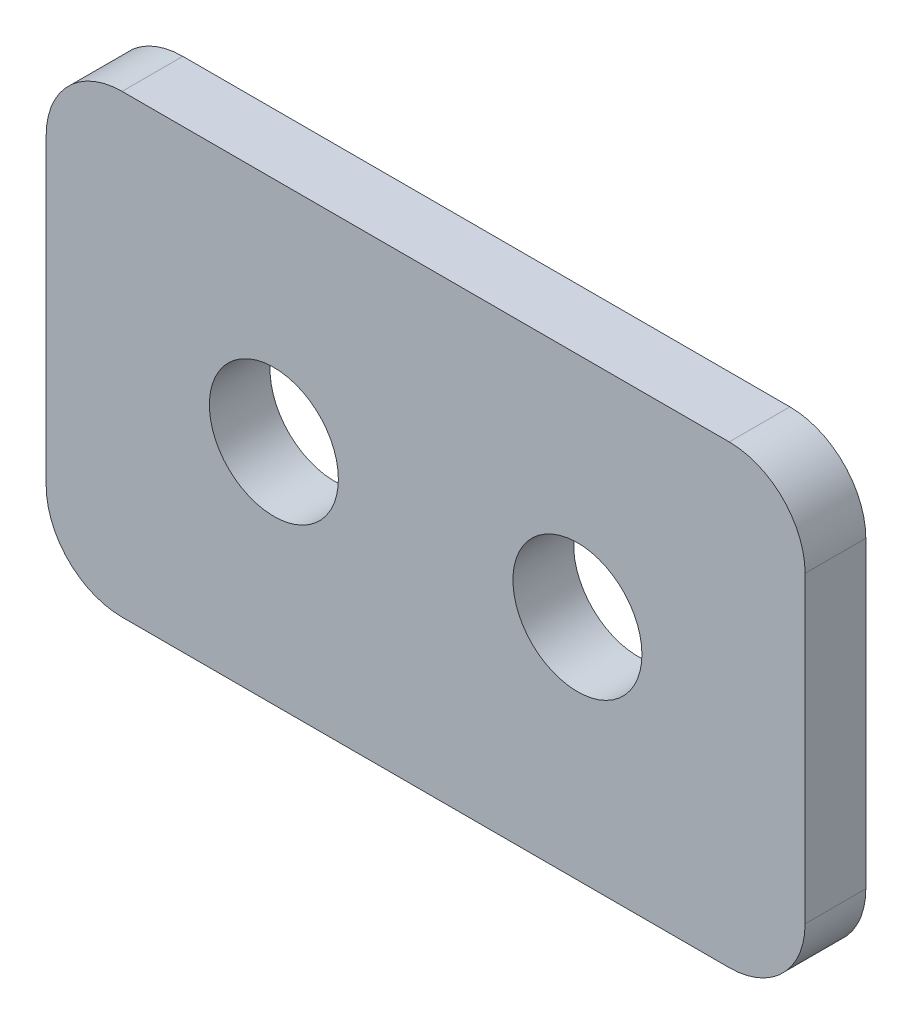
ISO-10303-21;
HEADER;
FILE_DESCRIPTION(('STEP AP214'),'2;1');
FILE_NAME('part.step','',(''),(''),'','','');
FILE_SCHEMA(('AUTOMOTIVE_DESIGN { 1 0 10303 214 1 1 1 1 }'));
ENDSEC;
DATA;
#1=APPLICATION_CONTEXT('core data for automotive mechanical design processes');
#2=APPLICATION_PROTOCOL_DEFINITION('international standard','automotive_design',2000,#1);
#3=PRODUCT_CONTEXT('',#1,'mechanical');
#4=PRODUCT('Part','Part','',(#3));
#5=PRODUCT_RELATED_PRODUCT_CATEGORY('part','',(#4));
#6=PRODUCT_DEFINITION_FORMATION('','',#4);
#7=PRODUCT_DEFINITION_CONTEXT('part definition',#1,'design');
#8=PRODUCT_DEFINITION('design','',#6,#7);
#9=PRODUCT_DEFINITION_SHAPE('','',#8);
#10=(LENGTH_UNIT() NAMED_UNIT(*) SI_UNIT(.MILLI.,.METRE.));
#11=(NAMED_UNIT(*) PLANE_ANGLE_UNIT() SI_UNIT($,.RADIAN.));
#12=(NAMED_UNIT(*) SI_UNIT($,.STERADIAN.) SOLID_ANGLE_UNIT());
#13=UNCERTAINTY_MEASURE_WITH_UNIT(LENGTH_MEASURE(1.E-05),#10,'distance_accuracy_value','');
#14=(GEOMETRIC_REPRESENTATION_CONTEXT(3) GLOBAL_UNCERTAINTY_ASSIGNED_CONTEXT((#13)) GLOBAL_UNIT_ASSIGNED_CONTEXT((#10,
#11,#12)) REPRESENTATION_CONTEXT('',''));
#15=CARTESIAN_POINT('',(0.,0.,0.));
#16=DIRECTION('',(0.,0.,1.));
#17=DIRECTION('',(1.,0.,0.));
#18=AXIS2_PLACEMENT_3D('',#15,#16,#17);
#19=CARTESIAN_POINT('',(-20.,-10.,-4.));
#20=DIRECTION('',(0.,0.,1.));
#21=DIRECTION('',(1.,0.,0.));
#22=AXIS2_PLACEMENT_3D('',#19,#20,#21);
#23=CYLINDRICAL_SURFACE('',#22,5.);
#24=CARTESIAN_POINT('',(-20.,-10.,0.));
#25=DIRECTION('',(0.,0.,1.));
#26=DIRECTION('',(-1.,0.,0.));
#27=AXIS2_PLACEMENT_3D('',#24,#25,#26);
#28=CIRCLE('',#27,5.);
#29=CARTESIAN_POINT('',(-25.,-9.99999999999996,0.));
#30=VERTEX_POINT('',#29);
#31=CARTESIAN_POINT('',(-20.,-15.,0.));
#32=VERTEX_POINT('',#31);
#33=EDGE_CURVE('E137',#30,#32,#28,.T.);
#34=ORIENTED_EDGE('',*,*,#33,.F.);
#35=DIRECTION('',(0.,0.,1.));
#36=VECTOR('',#35,1.);
#37=CARTESIAN_POINT('',(-25.,-9.99999999999996,-4.));
#38=LINE('',#37,#36);
#39=CARTESIAN_POINT('',(-25.,-9.99999999999996,-4.));
#40=VERTEX_POINT('',#39);
#41=EDGE_CURVE('E11',#40,#30,#38,.T.);
#42=ORIENTED_EDGE('',*,*,#41,.F.);
#43=CARTESIAN_POINT('',(-20.,-10.,-4.));
#44=DIRECTION('',(0.,0.,1.));
#45=DIRECTION('',(-1.,0.,0.));
#46=AXIS2_PLACEMENT_3D('',#43,#44,#45);
#47=CIRCLE('',#46,5.);
#48=CARTESIAN_POINT('',(-20.,-15.,-4.));
#49=VERTEX_POINT('',#48);
#50=EDGE_CURVE('E158',#40,#49,#47,.T.);
#51=ORIENTED_EDGE('',*,*,#50,.T.);
#52=DIRECTION('',(0.,0.,1.));
#53=VECTOR('',#52,1.);
#54=CARTESIAN_POINT('',(-20.,-15.,-4.));
#55=LINE('',#54,#53);
#56=EDGE_CURVE('E43',#49,#32,#55,.T.);
#57=ORIENTED_EDGE('',*,*,#56,.T.);
#58=EDGE_LOOP('',(#34,#42,#51,#57));
#59=FACE_BOUND('',#58,.T.);
#60=ADVANCED_FACE('F40',(#59),#23,.T.);
#61=CARTESIAN_POINT('',(-25.,-9.99999999999996,-4.));
#62=DIRECTION('',(-1.,0.,0.));
#63=DIRECTION('',(0.,0.,1.));
#64=AXIS2_PLACEMENT_3D('',#61,#62,#63);
#65=PLANE('',#64);
#66=DIRECTION('',(0.,-1.,0.));
#67=VECTOR('',#66,1.);
#68=CARTESIAN_POINT('',(-25.,-9.99999999999996,0.));
#69=LINE('',#68,#67);
#70=CARTESIAN_POINT('',(-25.,9.99999999999996,0.));
#71=VERTEX_POINT('',#70);
#72=EDGE_CURVE('E156',#71,#30,#69,.T.);
#73=ORIENTED_EDGE('',*,*,#72,.F.);
#74=DIRECTION('',(0.,0.,1.));
#75=VECTOR('',#74,1.);
#76=CARTESIAN_POINT('',(-25.,9.99999999999996,-4.));
#77=LINE('',#76,#75);
#78=CARTESIAN_POINT('',(-25.,9.99999999999996,-4.));
#79=VERTEX_POINT('',#78);
#80=EDGE_CURVE('E49',#79,#71,#77,.T.);
#81=ORIENTED_EDGE('',*,*,#80,.F.);
#82=DIRECTION('',(0.,-1.,0.));
#83=VECTOR('',#82,1.);
#84=CARTESIAN_POINT('',(-25.,-9.99999999999996,-4.));
#85=LINE('',#84,#83);
#86=EDGE_CURVE('E127',#79,#40,#85,.T.);
#87=ORIENTED_EDGE('',*,*,#86,.T.);
#88=ORIENTED_EDGE('',*,*,#41,.T.);
#89=EDGE_LOOP('',(#73,#81,#87,#88));
#90=FACE_BOUND('',#89,.T.);
#91=ADVANCED_FACE('F170',(#90),#65,.T.);
#92=CARTESIAN_POINT('',(-20.,10.,-4.));
#93=DIRECTION('',(0.,0.,1.));
#94=DIRECTION('',(1.,0.,0.));
#95=AXIS2_PLACEMENT_3D('',#92,#93,#94);
#96=CYLINDRICAL_SURFACE('',#95,5.);
#97=CARTESIAN_POINT('',(-20.,10.,0.));
#98=DIRECTION('',(0.,0.,1.));
#99=DIRECTION('',(-1.,0.,0.));
#100=AXIS2_PLACEMENT_3D('',#97,#98,#99);
#101=CIRCLE('',#100,5.);
#102=CARTESIAN_POINT('',(-20.,15.,0.));
#103=VERTEX_POINT('',#102);
#104=EDGE_CURVE('E114',#103,#71,#101,.T.);
#105=ORIENTED_EDGE('',*,*,#104,.F.);
#106=DIRECTION('',(0.,0.,1.));
#107=VECTOR('',#106,1.);
#108=CARTESIAN_POINT('',(-20.,15.,-4.));
#109=LINE('',#108,#107);
#110=CARTESIAN_POINT('',(-20.,15.,-4.));
#111=VERTEX_POINT('',#110);
#112=EDGE_CURVE('E109',#111,#103,#109,.T.);
#113=ORIENTED_EDGE('',*,*,#112,.F.);
#114=CARTESIAN_POINT('',(-20.,10.,-4.));
#115=DIRECTION('',(0.,0.,1.));
#116=DIRECTION('',(-1.,0.,0.));
#117=AXIS2_PLACEMENT_3D('',#114,#115,#116);
#118=CIRCLE('',#117,5.);
#119=EDGE_CURVE('E112',#111,#79,#118,.T.);
#120=ORIENTED_EDGE('',*,*,#119,.T.);
#121=ORIENTED_EDGE('',*,*,#80,.T.);
#122=EDGE_LOOP('',(#105,#113,#120,#121));
#123=FACE_BOUND('',#122,.T.);
#124=ADVANCED_FACE('F111',(#123),#96,.T.);
#125=CARTESIAN_POINT('',(-20.,15.,-4.));
#126=DIRECTION('',(0.,1.,0.));
#127=DIRECTION('',(0.,0.,1.));
#128=AXIS2_PLACEMENT_3D('',#125,#126,#127);
#129=PLANE('',#128);
#130=DIRECTION('',(-1.,0.,0.));
#131=VECTOR('',#130,1.);
#132=CARTESIAN_POINT('',(-20.,15.,0.));
#133=LINE('',#132,#131);
#134=CARTESIAN_POINT('',(20.,15.,0.));
#135=VERTEX_POINT('',#134);
#136=EDGE_CURVE('E153',#135,#103,#133,.T.);
#137=ORIENTED_EDGE('',*,*,#136,.F.);
#138=DIRECTION('',(0.,0.,1.));
#139=VECTOR('',#138,1.);
#140=CARTESIAN_POINT('',(20.,15.,-4.));
#141=LINE('',#140,#139);
#142=CARTESIAN_POINT('',(20.,15.,-4.));
#143=VERTEX_POINT('',#142);
#144=EDGE_CURVE('E119',#143,#135,#141,.T.);
#145=ORIENTED_EDGE('',*,*,#144,.F.);
#146=DIRECTION('',(-1.,0.,0.));
#147=VECTOR('',#146,1.);
#148=CARTESIAN_POINT('',(-20.,15.,-4.));
#149=LINE('',#148,#147);
#150=EDGE_CURVE('E125',#143,#111,#149,.T.);
#151=ORIENTED_EDGE('',*,*,#150,.T.);
#152=ORIENTED_EDGE('',*,*,#112,.T.);
#153=EDGE_LOOP('',(#137,#145,#151,#152));
#154=FACE_BOUND('',#153,.T.);
#155=ADVANCED_FACE('F129',(#154),#129,.T.);
#156=CARTESIAN_POINT('',(20.,10.,-4.));
#157=DIRECTION('',(0.,0.,1.));
#158=DIRECTION('',(1.,0.,0.));
#159=AXIS2_PLACEMENT_3D('',#156,#157,#158);
#160=CYLINDRICAL_SURFACE('',#159,5.);
#161=CARTESIAN_POINT('',(20.,10.,0.));
#162=DIRECTION('',(0.,0.,1.));
#163=DIRECTION('',(-1.,0.,0.));
#164=AXIS2_PLACEMENT_3D('',#161,#162,#163);
#165=CIRCLE('',#164,5.);
#166=CARTESIAN_POINT('',(25.,9.99999999999996,0.));
#167=VERTEX_POINT('',#166);
#168=EDGE_CURVE('E150',#167,#135,#165,.T.);
#169=ORIENTED_EDGE('',*,*,#168,.F.);
#170=DIRECTION('',(0.,0.,1.));
#171=VECTOR('',#170,1.);
#172=CARTESIAN_POINT('',(25.,9.99999999999996,-4.));
#173=LINE('',#172,#171);
#174=CARTESIAN_POINT('',(25.,9.99999999999996,-4.));
#175=VERTEX_POINT('',#174);
#176=EDGE_CURVE('E162',#175,#167,#173,.T.);
#177=ORIENTED_EDGE('',*,*,#176,.F.);
#178=CARTESIAN_POINT('',(20.,10.,-4.));
#179=DIRECTION('',(0.,0.,1.));
#180=DIRECTION('',(-1.,0.,0.));
#181=AXIS2_PLACEMENT_3D('',#178,#179,#180);
#182=CIRCLE('',#181,5.);
#183=EDGE_CURVE('E130',#175,#143,#182,.T.);
#184=ORIENTED_EDGE('',*,*,#183,.T.);
#185=ORIENTED_EDGE('',*,*,#144,.T.);
#186=EDGE_LOOP('',(#169,#177,#184,#185));
#187=FACE_BOUND('',#186,.T.);
#188=ADVANCED_FACE('F183',(#187),#160,.T.);
#189=CARTESIAN_POINT('',(25.,-9.99999999999996,-4.));
#190=DIRECTION('',(1.,0.,0.));
#191=DIRECTION('',(0.,1.,0.));
#192=AXIS2_PLACEMENT_3D('',#189,#190,#191);
#193=PLANE('',#192);
#194=DIRECTION('',(0.,1.,0.));
#195=VECTOR('',#194,1.);
#196=CARTESIAN_POINT('',(25.,-9.99999999999996,0.));
#197=LINE('',#196,#195);
#198=CARTESIAN_POINT('',(25.,-10.,0.));
#199=VERTEX_POINT('',#198);
#200=EDGE_CURVE('E147',#199,#167,#197,.T.);
#201=ORIENTED_EDGE('',*,*,#200,.F.);
#202=DIRECTION('',(0.,0.,1.));
#203=VECTOR('',#202,1.);
#204=CARTESIAN_POINT('',(25.,-10.,-4.));
#205=LINE('',#204,#203);
#206=CARTESIAN_POINT('',(25.,-10.,-4.));
#207=VERTEX_POINT('',#206);
#208=EDGE_CURVE('E164',#207,#199,#205,.T.);
#209=ORIENTED_EDGE('',*,*,#208,.F.);
#210=DIRECTION('',(0.,1.,0.));
#211=VECTOR('',#210,1.);
#212=CARTESIAN_POINT('',(25.,-9.99999999999996,-4.));
#213=LINE('',#212,#211);
#214=EDGE_CURVE('E132',#207,#175,#213,.T.);
#215=ORIENTED_EDGE('',*,*,#214,.T.);
#216=ORIENTED_EDGE('',*,*,#176,.T.);
#217=EDGE_LOOP('',(#201,#209,#215,#216));
#218=FACE_BOUND('',#217,.T.);
#219=ADVANCED_FACE('F186',(#218),#193,.T.);
#220=CARTESIAN_POINT('',(20.,-10.,-4.));
#221=DIRECTION('',(0.,0.,1.));
#222=DIRECTION('',(1.,0.,0.));
#223=AXIS2_PLACEMENT_3D('',#220,#221,#222);
#224=CYLINDRICAL_SURFACE('',#223,5.);
#225=CARTESIAN_POINT('',(20.,-10.,0.));
#226=DIRECTION('',(0.,0.,1.));
#227=DIRECTION('',(1.,0.,0.));
#228=AXIS2_PLACEMENT_3D('',#225,#226,#227);
#229=CIRCLE('',#228,5.);
#230=CARTESIAN_POINT('',(20.,-15.,0.));
#231=VERTEX_POINT('',#230);
#232=EDGE_CURVE('E144',#231,#199,#229,.T.);
#233=ORIENTED_EDGE('',*,*,#232,.F.);
#234=DIRECTION('',(0.,0.,1.));
#235=VECTOR('',#234,1.);
#236=CARTESIAN_POINT('',(20.,-15.,-4.));
#237=LINE('',#236,#235);
#238=CARTESIAN_POINT('',(20.,-15.,-4.));
#239=VERTEX_POINT('',#238);
#240=EDGE_CURVE('E165',#239,#231,#237,.T.);
#241=ORIENTED_EDGE('',*,*,#240,.F.);
#242=CARTESIAN_POINT('',(20.,-10.,-4.));
#243=DIRECTION('',(0.,0.,1.));
#244=DIRECTION('',(1.,0.,0.));
#245=AXIS2_PLACEMENT_3D('',#242,#243,#244);
#246=CIRCLE('',#245,5.);
#247=EDGE_CURVE('E232',#239,#207,#246,.T.);
#248=ORIENTED_EDGE('',*,*,#247,.T.);
#249=ORIENTED_EDGE('',*,*,#208,.T.);
#250=EDGE_LOOP('',(#233,#241,#248,#249));
#251=FACE_BOUND('',#250,.T.);
#252=ADVANCED_FACE('F190',(#251),#224,.T.);
#253=CARTESIAN_POINT('',(-20.,-15.,-4.));
#254=DIRECTION('',(0.,-1.,0.));
#255=DIRECTION('',(0.,0.,-1.));
#256=AXIS2_PLACEMENT_3D('',#253,#254,#255);
#257=PLANE('',#256);
#258=DIRECTION('',(1.,0.,0.));
#259=VECTOR('',#258,1.);
#260=CARTESIAN_POINT('',(-20.,-15.,0.));
#261=LINE('',#260,#259);
#262=EDGE_CURVE('E140',#32,#231,#261,.T.);
#263=ORIENTED_EDGE('',*,*,#262,.F.);
#264=ORIENTED_EDGE('',*,*,#56,.F.);
#265=DIRECTION('',(1.,0.,0.));
#266=VECTOR('',#265,1.);
#267=CARTESIAN_POINT('',(-20.,-15.,-4.));
#268=LINE('',#267,#266);
#269=EDGE_CURVE('E230',#49,#239,#268,.T.);
#270=ORIENTED_EDGE('',*,*,#269,.T.);
#271=ORIENTED_EDGE('',*,*,#240,.T.);
#272=EDGE_LOOP('',(#263,#264,#270,#271));
#273=FACE_BOUND('',#272,.T.);
#274=ADVANCED_FACE('F167',(#273),#257,.T.);
#275=CARTESIAN_POINT('',(-20.,-10.,-4.));
#276=DIRECTION('',(0.,0.,-1.));
#277=DIRECTION('',(-1.,0.,0.));
#278=AXIS2_PLACEMENT_3D('',#275,#276,#277);
#279=PLANE('',#278);
#280=CARTESIAN_POINT('',(10.,0.,-4.));
#281=DIRECTION('',(0.,0.,1.));
#282=DIRECTION('',(1.,0.,0.));
#283=AXIS2_PLACEMENT_3D('',#280,#281,#282);
#284=CIRCLE('',#283,4.25);
#285=CARTESIAN_POINT('',(14.25,0.,-4.));
#286=VERTEX_POINT('',#285);
#287=EDGE_CURVE('E217',#286,#286,#284,.T.);
#288=ORIENTED_EDGE('',*,*,#287,.T.);
#289=EDGE_LOOP('',(#288));
#290=FACE_BOUND('',#289,.T.);
#291=CARTESIAN_POINT('',(-10.,0.,-4.));
#292=DIRECTION('',(0.,0.,1.));
#293=DIRECTION('',(1.,0.,0.));
#294=AXIS2_PLACEMENT_3D('',#291,#292,#293);
#295=CIRCLE('',#294,4.25);
#296=CARTESIAN_POINT('',(-5.75,0.,-4.));
#297=VERTEX_POINT('',#296);
#298=EDGE_CURVE('E141',#297,#297,#295,.T.);
#299=ORIENTED_EDGE('',*,*,#298,.T.);
#300=EDGE_LOOP('',(#299));
#301=FACE_BOUND('',#300,.T.);
#302=ORIENTED_EDGE('',*,*,#50,.F.);
#303=ORIENTED_EDGE('',*,*,#86,.F.);
#304=ORIENTED_EDGE('',*,*,#119,.F.);
#305=ORIENTED_EDGE('',*,*,#150,.F.);
#306=ORIENTED_EDGE('',*,*,#183,.F.);
#307=ORIENTED_EDGE('',*,*,#214,.F.);
#308=ORIENTED_EDGE('',*,*,#247,.F.);
#309=ORIENTED_EDGE('',*,*,#269,.F.);
#310=EDGE_LOOP('',(#302,#303,#304,#305,#306,#307,#308,#309));
#311=FACE_BOUND('',#310,.T.);
#312=ADVANCED_FACE('F123',(#290,#301,#311),#279,.T.);
#313=CARTESIAN_POINT('',(-20.,-10.,0.));
#314=DIRECTION('',(0.,0.,-1.));
#315=DIRECTION('',(-1.,0.,0.));
#316=AXIS2_PLACEMENT_3D('',#313,#314,#315);
#317=PLANE('',#316);
#318=CARTESIAN_POINT('',(10.,0.,0.));
#319=DIRECTION('',(0.,0.,1.));
#320=DIRECTION('',(1.,0.,0.));
#321=AXIS2_PLACEMENT_3D('',#318,#319,#320);
#322=CIRCLE('',#321,4.25);
#323=CARTESIAN_POINT('',(14.25,0.,0.));
#324=VERTEX_POINT('',#323);
#325=EDGE_CURVE('E220',#324,#324,#322,.T.);
#326=ORIENTED_EDGE('',*,*,#325,.F.);
#327=EDGE_LOOP('',(#326));
#328=FACE_BOUND('',#327,.T.);
#329=CARTESIAN_POINT('',(-10.,0.,0.));
#330=DIRECTION('',(0.,0.,1.));
#331=DIRECTION('',(1.,0.,0.));
#332=AXIS2_PLACEMENT_3D('',#329,#330,#331);
#333=CIRCLE('',#332,4.25);
#334=CARTESIAN_POINT('',(-5.75,0.,0.));
#335=VERTEX_POINT('',#334);
#336=EDGE_CURVE('E222',#335,#335,#333,.T.);
#337=ORIENTED_EDGE('',*,*,#336,.F.);
#338=EDGE_LOOP('',(#337));
#339=FACE_BOUND('',#338,.T.);
#340=ORIENTED_EDGE('',*,*,#33,.T.);
#341=ORIENTED_EDGE('',*,*,#262,.T.);
#342=ORIENTED_EDGE('',*,*,#232,.T.);
#343=ORIENTED_EDGE('',*,*,#200,.T.);
#344=ORIENTED_EDGE('',*,*,#168,.T.);
#345=ORIENTED_EDGE('',*,*,#136,.T.);
#346=ORIENTED_EDGE('',*,*,#104,.T.);
#347=ORIENTED_EDGE('',*,*,#72,.T.);
#348=EDGE_LOOP('',(#340,#341,#342,#343,#344,#345,#346,#347));
#349=FACE_BOUND('',#348,.T.);
#350=ADVANCED_FACE('F169',(#328,#339,#349),#317,.F.);
#351=CARTESIAN_POINT('',(-10.,0.,-4.));
#352=DIRECTION('',(0.,0.,1.));
#353=DIRECTION('',(1.,0.,0.));
#354=AXIS2_PLACEMENT_3D('',#351,#352,#353);
#355=CYLINDRICAL_SURFACE('',#354,4.25);
#356=ORIENTED_EDGE('',*,*,#298,.F.);
#357=EDGE_LOOP('',(#356));
#358=FACE_BOUND('',#357,.T.);
#359=ORIENTED_EDGE('',*,*,#336,.T.);
#360=EDGE_LOOP('',(#359));
#361=FACE_BOUND('',#360,.T.);
#362=ADVANCED_FACE('F202',(#358,#361),#355,.F.);
#363=CARTESIAN_POINT('',(10.,0.,-4.));
#364=DIRECTION('',(0.,0.,1.));
#365=DIRECTION('',(1.,0.,0.));
#366=AXIS2_PLACEMENT_3D('',#363,#364,#365);
#367=CYLINDRICAL_SURFACE('',#366,4.25);
#368=ORIENTED_EDGE('',*,*,#287,.F.);
#369=EDGE_LOOP('',(#368));
#370=FACE_BOUND('',#369,.T.);
#371=ORIENTED_EDGE('',*,*,#325,.T.);
#372=EDGE_LOOP('',(#371));
#373=FACE_BOUND('',#372,.T.);
#374=ADVANCED_FACE('F209',(#370,#373),#367,.F.);
#375=CLOSED_SHELL('',(#60,#91,#124,#155,#188,#219,#252,#274,#312,#350,#362,#374));
#376=MANIFOLD_SOLID_BREP('B2',#375);
#377=ADVANCED_BREP_SHAPE_REPRESENTATION('',(#18,#376),#14);
#378=SHAPE_DEFINITION_REPRESENTATION(#9,#377);
ENDSEC;
END-ISO-10303-21;
